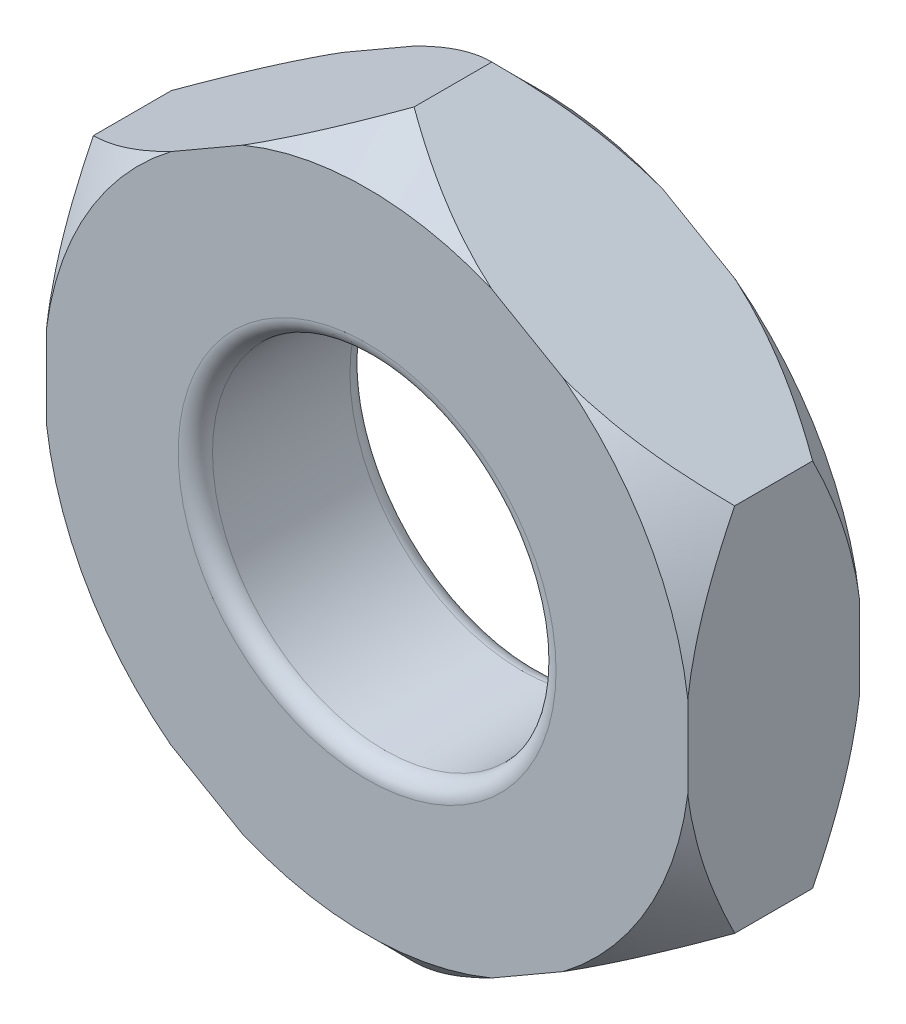
ISO-10303-21;
HEADER;
FILE_DESCRIPTION(('STEP AP214'),'2;1');
FILE_NAME('part.step','',(''),(''),'','','');
FILE_SCHEMA(('AUTOMOTIVE_DESIGN { 1 0 10303 214 1 1 1 1 }'));
ENDSEC;
DATA;
#1=APPLICATION_CONTEXT('core data for automotive mechanical design processes');
#2=APPLICATION_PROTOCOL_DEFINITION('international standard','automotive_design',2000,#1);
#3=PRODUCT_CONTEXT('',#1,'mechanical');
#4=PRODUCT('Part','Part','',(#3));
#5=PRODUCT_RELATED_PRODUCT_CATEGORY('part','',(#4));
#6=PRODUCT_DEFINITION_FORMATION('','',#4);
#7=PRODUCT_DEFINITION_CONTEXT('part definition',#1,'design');
#8=PRODUCT_DEFINITION('design','',#6,#7);
#9=PRODUCT_DEFINITION_SHAPE('','',#8);
#10=(LENGTH_UNIT() NAMED_UNIT(*) SI_UNIT(.MILLI.,.METRE.));
#11=(NAMED_UNIT(*) PLANE_ANGLE_UNIT() SI_UNIT($,.RADIAN.));
#12=(NAMED_UNIT(*) SI_UNIT($,.STERADIAN.) SOLID_ANGLE_UNIT());
#13=UNCERTAINTY_MEASURE_WITH_UNIT(LENGTH_MEASURE(1.E-05),#10,'distance_accuracy_value','');
#14=(GEOMETRIC_REPRESENTATION_CONTEXT(3) GLOBAL_UNCERTAINTY_ASSIGNED_CONTEXT((#13)) GLOBAL_UNIT_ASSIGNED_CONTEXT((#10,
#11,#12)) REPRESENTATION_CONTEXT('',''));
#15=CARTESIAN_POINT('',(0.,0.,0.));
#16=DIRECTION('',(0.,0.,1.));
#17=DIRECTION('',(1.,0.,0.));
#18=AXIS2_PLACEMENT_3D('',#15,#16,#17);
#19=CARTESIAN_POINT('',(2.8,1.61658075373095,-1.5));
#20=DIRECTION('',(0.5,0.866025403784439,0.));
#21=DIRECTION('',(-0.866025403784439,0.5,0.));
#22=AXIS2_PLACEMENT_3D('',#19,#20,#21);
#23=PLANE('',#22);
#24=DIRECTION('',(0.,0.,1.));
#25=VECTOR('',#24,1.);
#26=CARTESIAN_POINT('',(0.,3.2331615074619,-1.5));
#27=LINE('',#26,#25);
#28=CARTESIAN_POINT('',(0.,3.2331615074619,-1.09));
#29=VERTEX_POINT('',#28);
#30=CARTESIAN_POINT('',(0.,3.2331615074619,-0.41));
#31=VERTEX_POINT('',#30);
#32=EDGE_CURVE('E226',#29,#31,#27,.T.);
#33=ORIENTED_EDGE('',*,*,#32,.T.);
#34=CARTESIAN_POINT('',(-0.000700000000000846,3.23356565265034,-0.410404220956184));
#35=CARTESIAN_POINT('',(0.0955795792537454,3.17797861165072,-0.354849873121502));
#36=CARTESIAN_POINT('',(0.193469381876273,3.12146190775569,-0.302556963805771));
#37=CARTESIAN_POINT('',(0.393079210730305,3.00621711933392,-0.206807483108219));
#38=CARTESIAN_POINT('',(0.494818246616698,2.94747805957781,-0.163404228206856));
#39=CARTESIAN_POINT('',(0.699970477221649,2.82903336401319,-0.0890522572489255));
#40=CARTESIAN_POINT('',(0.803331354963252,2.7693579334254,-0.0579165382244305));
#41=CARTESIAN_POINT('',(1.0123300305261,2.64869249182891,-0.00994422958304566));
#42=CARTESIAN_POINT('',(1.11796143266115,2.58770617337137,0.00692820351901804));
#43=CARTESIAN_POINT('',(1.29998719470626,2.48261355065518,0.0221505785545191));
#44=CARTESIAN_POINT('',(1.3761460079225,2.43864323934362,0.0244055655288745));
#45=CARTESIAN_POINT('',(1.52833940842187,2.35077433859642,0.0206179327519953));
#46=CARTESIAN_POINT('',(1.60437394277193,2.30687577972171,0.0145724027412969));
#47=CARTESIAN_POINT('',(1.75572535689394,2.21949300003614,-0.00547225076720786));
#48=CARTESIAN_POINT('',(1.83104133666574,2.17600929884061,-0.0194802822999276));
#49=CARTESIAN_POINT('',(1.9803709995267,2.08979377778984,-0.0546809380405418));
#50=CARTESIAN_POINT('',(2.05438478190802,2.04706190060824,-0.0758730119480628));
#51=CARTESIAN_POINT('',(2.24405961895124,1.93755308238283,-0.138818795266773));
#52=CARTESIAN_POINT('',(2.35854209435516,1.87145659439089,-0.185328242984652));
#53=CARTESIAN_POINT('',(2.52687591199396,1.77426901946341,-0.263847340242155));
#54=CARTESIAN_POINT('',(2.5823490484883,1.74224158917561,-0.291436083477535));
#55=CARTESIAN_POINT('',(2.69226689627911,1.67878049016484,-0.349129274164181));
#56=CARTESIAN_POINT('',(2.74671221623508,1.64734647003215,-0.379232171564));
#57=CARTESIAN_POINT('',(2.8007,1.61617660854252,-0.410404220956184));
#58=B_SPLINE_CURVE_WITH_KNOTS('',3,(#34,#35,#36,#37,#38,#39,#40,#41,#42,#43,#44,#45,#46,#47,#48,
#49,#50,#51,#52,#53,#54,#55,#56,#57),.UNSPECIFIED.,.F.,.F.,(4,2,2,2,2,2,2,2,2,2,2,4),(0.,
0.373103823161989,0.748383760008528,1.11769848841447,1.48608235037116,1.74961742332421,
2.01324491839073,2.27716792838043,2.54107072633384,2.96059684404477,3.16979164088213,
3.37885840170202),.UNSPECIFIED.);
#59=CARTESIAN_POINT('',(1.08746092578539,2.60531564922651,0.));
#60=VERTEX_POINT('',#59);
#61=EDGE_CURVE('E194',#31,#60,#58,.T.);
#62=ORIENTED_EDGE('',*,*,#61,.T.);
#63=DIRECTION('',(-0.866025403784439,0.5,0.));
#64=VECTOR('',#63,1.);
#65=CARTESIAN_POINT('',(2.8,1.61658075373095,0.));
#66=LINE('',#65,#64);
#67=CARTESIAN_POINT('',(1.71253907421461,2.24442661196635,0.));
#68=VERTEX_POINT('',#67);
#69=EDGE_CURVE('E191',#68,#60,#66,.T.);
#70=ORIENTED_EDGE('',*,*,#69,.F.);
#71=CARTESIAN_POINT('',(2.8,1.61658075373095,-0.41));
#72=VERTEX_POINT('',#71);
#73=EDGE_CURVE('E173',#68,#72,#58,.T.);
#74=ORIENTED_EDGE('',*,*,#73,.T.);
#75=DIRECTION('',(0.,0.,1.));
#76=VECTOR('',#75,1.);
#77=CARTESIAN_POINT('',(2.8,1.61658075373095,-1.5));
#78=LINE('',#77,#76);
#79=CARTESIAN_POINT('',(2.8,1.61658075373095,-1.09));
#80=VERTEX_POINT('',#79);
#81=EDGE_CURVE('E188',#80,#72,#78,.T.);
#82=ORIENTED_EDGE('',*,*,#81,.F.);
#83=CARTESIAN_POINT('',(2.8007,1.61617660854252,-1.08959577904382));
#84=CARTESIAN_POINT('',(2.70442042074625,1.67176364954213,-1.1451501268785));
#85=CARTESIAN_POINT('',(2.60653061812372,1.72828035343717,-1.19744303619423));
#86=CARTESIAN_POINT('',(2.40692078926969,1.84352514185894,-1.29319251689178));
#87=CARTESIAN_POINT('',(2.3051817533833,1.90226420161504,-1.33659577179314));
#88=CARTESIAN_POINT('',(2.10002952277835,2.02070889717966,-1.41094774275107));
#89=CARTESIAN_POINT('',(1.99666864503675,2.08038432776745,-1.44208346177557));
#90=CARTESIAN_POINT('',(1.78766996947389,2.20104976936394,-1.49005577041695));
#91=CARTESIAN_POINT('',(1.68203856733885,2.26203608782149,-1.50692820351902));
#92=CARTESIAN_POINT('',(1.50001280529374,2.36712871053768,-1.52215057855452));
#93=CARTESIAN_POINT('',(1.4238539920775,2.41109902184923,-1.52440556552887));
#94=CARTESIAN_POINT('',(1.27166059157812,2.49896792259644,-1.520617932752));
#95=CARTESIAN_POINT('',(1.19562605722807,2.54286648147115,-1.5145724027413));
#96=CARTESIAN_POINT('',(1.04427464310606,2.63024926115672,-1.49452774923279));
#97=CARTESIAN_POINT('',(0.968958663334262,2.67373296235225,-1.48051971770007));
#98=CARTESIAN_POINT('',(0.8196290004733,2.75994848340302,-1.44531906195946));
#99=CARTESIAN_POINT('',(0.745615218091976,2.80268036058462,-1.42412698805194));
#100=CARTESIAN_POINT('',(0.555940381048752,2.91218917881002,-1.36118120473323));
#101=CARTESIAN_POINT('',(0.441457905644836,2.97828566680197,-1.31467175701535));
#102=CARTESIAN_POINT('',(0.273124088006036,3.07547324172945,-1.23615265975784));
#103=CARTESIAN_POINT('',(0.217650951511699,3.10750067201725,-1.20856391652246));
#104=CARTESIAN_POINT('',(0.107733103720892,3.17096177102801,-1.15087072583582));
#105=CARTESIAN_POINT('',(0.0532877837649167,3.20239579116071,-1.120767828436));
#106=CARTESIAN_POINT('',(-0.000700000000000954,3.23356565265034,-1.08959577904382));
#107=B_SPLINE_CURVE_WITH_KNOTS('',3,(#83,#84,#85,#86,#87,#88,#89,#90,#91,#92,#93,#94,#95,#96,
#97,#98,#99,#100,#101,#102,#103,#104,#105,#106),.UNSPECIFIED.,.F.,.F.,(4,2,2,2,2,2,2,2,2,2,2,4),
(0.,0.37310382316199,0.748383760008529,1.11769848841447,1.48608235037116,1.74961742332422,
2.01324491839073,2.27716792838043,2.54107072633385,2.96059684404477,3.16979164088213,
3.37885840170202),.UNSPECIFIED.);
#108=CARTESIAN_POINT('',(1.71253907421461,2.24442661196635,-1.5));
#109=VERTEX_POINT('',#108);
#110=EDGE_CURVE('E289',#80,#109,#107,.T.);
#111=ORIENTED_EDGE('',*,*,#110,.T.);
#112=DIRECTION('',(-0.866025403784439,0.5,0.));
#113=VECTOR('',#112,1.);
#114=CARTESIAN_POINT('',(2.8,1.61658075373095,-1.5));
#115=LINE('',#114,#113);
#116=CARTESIAN_POINT('',(1.08746092578539,2.60531564922651,-1.5));
#117=VERTEX_POINT('',#116);
#118=EDGE_CURVE('E308',#109,#117,#115,.T.);
#119=ORIENTED_EDGE('',*,*,#118,.T.);
#120=EDGE_CURVE('E363',#117,#29,#107,.T.);
#121=ORIENTED_EDGE('',*,*,#120,.T.);
#122=EDGE_LOOP('',(#33,#62,#70,#74,#82,#111,#119,#121));
#123=FACE_BOUND('',#122,.T.);
#124=ADVANCED_FACE('F45',(#123),#23,.T.);
#125=CARTESIAN_POINT('',(2.8,-1.61658075373095,-1.5));
#126=DIRECTION('',(1.,0.,0.));
#127=DIRECTION('',(0.,1.,0.));
#128=AXIS2_PLACEMENT_3D('',#125,#126,#127);
#129=PLANE('',#128);
#130=ORIENTED_EDGE('',*,*,#81,.T.);
#131=CARTESIAN_POINT('',(2.8,1.61728075373095,-0.410350056826765));
#132=CARTESIAN_POINT('',(2.8,1.5061132044498,-0.354801739725092));
#133=CARTESIAN_POINT('',(2.8,1.39308650464855,-0.302514761587192));
#134=CARTESIAN_POINT('',(2.8,1.16261098930572,-0.206776595658489));
#135=CARTESIAN_POINT('',(2.8,1.04514023039158,-0.163378710150931));
#136=CARTESIAN_POINT('',(2.8,0.808265751829126,-0.0890361916040844));
#137=CARTESIAN_POINT('',(2.8,0.688922423484141,-0.0579046025060009));
#138=CARTESIAN_POINT('',(2.8,0.44760709093306,-0.00993889771627575));
#139=CARTESIAN_POINT('',(2.8,0.325642468927563,0.00693105017102933));
#140=CARTESIAN_POINT('',(2.8,0.115465648657877,0.0221513605774256));
#141=CARTESIAN_POINT('',(2.8,0.0275253401569487,0.0244057395858546));
#142=CARTESIAN_POINT('',(2.8,-0.148211774585028,0.0206169601469645));
#143=CARTESIAN_POINT('',(2.8,-0.236008519689951,0.0145708917162211));
#144=CARTESIAN_POINT('',(2.8,-0.410773272932057,-0.00547473579486275));
#145=CARTESIAN_POINT('',(2.8,-0.497740242039395,-0.0194832007149876));
#146=CARTESIAN_POINT('',(2.8,-0.670170403090646,-0.054684609093444));
#147=CARTESIAN_POINT('',(2.8,-0.755633709707737,-0.0758770021668286));
#148=CARTESIAN_POINT('',(2.8,-0.974628859993182,-0.138817339838187));
#149=CARTESIAN_POINT('',(2.8,-1.10680050831653,-0.185318441699055));
#150=CARTESIAN_POINT('',(2.8,-1.30114489540137,-0.263822507348058));
#151=CARTESIAN_POINT('',(2.8,-1.365189703445,-0.291405822154836));
#152=CARTESIAN_POINT('',(2.8,-1.49209218141063,-0.349087507187175));
#153=CARTESIAN_POINT('',(2.8,-1.55495055343731,-0.379184328870487));
#154=CARTESIAN_POINT('',(2.8,-1.61728075373095,-0.410350056826767));
#155=B_SPLINE_CURVE_WITH_KNOTS('',3,(#131,#132,#133,#134,#135,#136,#137,#138,#139,#140,#141,
#142,#143,#144,#145,#146,#147,#148,#149,#150,#151,#152,#153,#154),.UNSPECIFIED.,.F.,.F.,(4,2,2,
2,2,2,2,2,2,2,2,4),(0.,0.37307814749604,0.748331832287194,1.11762166860141,1.48598088771918,
1.74951497173894,2.01314146953365,2.27706341209962,2.54096513928425,2.96042302480115,
3.16958369143192,3.37861643402933),.UNSPECIFIED.);
#156=CARTESIAN_POINT('',(2.8,0.360889037260158,0.));
#157=VERTEX_POINT('',#156);
#158=EDGE_CURVE('E170',#72,#157,#155,.T.);
#159=ORIENTED_EDGE('',*,*,#158,.T.);
#160=DIRECTION('',(0.,1.,0.));
#161=VECTOR('',#160,1.);
#162=CARTESIAN_POINT('',(2.8,-1.61658075373095,0.));
#163=LINE('',#162,#161);
#164=CARTESIAN_POINT('',(2.8,-0.360889037260154,0.));
#165=VERTEX_POINT('',#164);
#166=EDGE_CURVE('E212',#165,#157,#163,.T.);
#167=ORIENTED_EDGE('',*,*,#166,.F.);
#168=CARTESIAN_POINT('',(2.8,-1.61658075373095,-0.41));
#169=VERTEX_POINT('',#168);
#170=EDGE_CURVE('E181',#165,#169,#155,.T.);
#171=ORIENTED_EDGE('',*,*,#170,.T.);
#172=DIRECTION('',(0.,0.,1.));
#173=VECTOR('',#172,1.);
#174=CARTESIAN_POINT('',(2.8,-1.61658075373095,-1.5));
#175=LINE('',#174,#173);
#176=CARTESIAN_POINT('',(2.8,-1.61658075373095,-1.09));
#177=VERTEX_POINT('',#176);
#178=EDGE_CURVE('E201',#177,#169,#175,.T.);
#179=ORIENTED_EDGE('',*,*,#178,.F.);
#180=CARTESIAN_POINT('',(2.8,-1.61728075373095,-1.08964994317323));
#181=CARTESIAN_POINT('',(2.8,-1.50611320444979,-1.14519826027491));
#182=CARTESIAN_POINT('',(2.8,-1.39308650464855,-1.19748523841281));
#183=CARTESIAN_POINT('',(2.8,-1.16261098930572,-1.29322340434151));
#184=CARTESIAN_POINT('',(2.8,-1.04514023039158,-1.33662128984907));
#185=CARTESIAN_POINT('',(2.8,-0.808265751829124,-1.41096380839592));
#186=CARTESIAN_POINT('',(2.8,-0.688922423484138,-1.442095397494));
#187=CARTESIAN_POINT('',(2.8,-0.447607090933057,-1.49006110228372));
#188=CARTESIAN_POINT('',(2.8,-0.32564246892756,-1.50693105017103));
#189=CARTESIAN_POINT('',(2.8,-0.115465648657873,-1.52215136057743));
#190=CARTESIAN_POINT('',(2.8,-0.0275253401569455,-1.52440573958585));
#191=CARTESIAN_POINT('',(2.8,0.148211774585031,-1.52061696014696));
#192=CARTESIAN_POINT('',(2.8,0.236008519689954,-1.51457089171622));
#193=CARTESIAN_POINT('',(2.8,0.41077327293206,-1.49452526420514));
#194=CARTESIAN_POINT('',(2.8,0.497740242039397,-1.48051679928501));
#195=CARTESIAN_POINT('',(2.8,0.670170403090649,-1.44531539090656));
#196=CARTESIAN_POINT('',(2.8,0.75563370970774,-1.42412299783317));
#197=CARTESIAN_POINT('',(2.8,0.974628859993185,-1.36118266016181));
#198=CARTESIAN_POINT('',(2.8,1.10680050831653,-1.31468155830095));
#199=CARTESIAN_POINT('',(2.8,1.30114489540137,-1.23617749265194));
#200=CARTESIAN_POINT('',(2.8,1.365189703445,-1.20859417784517));
#201=CARTESIAN_POINT('',(2.8,1.49209218141063,-1.15091249281283));
#202=CARTESIAN_POINT('',(2.8,1.55495055343731,-1.12081567112951));
#203=CARTESIAN_POINT('',(2.8,1.61728075373095,-1.08964994317323));
#204=B_SPLINE_CURVE_WITH_KNOTS('',3,(#180,#181,#182,#183,#184,#185,#186,#187,#188,#189,#190,
#191,#192,#193,#194,#195,#196,#197,#198,#199,#200,#201,#202,#203),.UNSPECIFIED.,.F.,.F.,(4,2,2,
2,2,2,2,2,2,2,2,4),(0.,0.373078147496041,0.748331832287196,1.11762166860141,1.48598088771918,
1.74951497173894,2.01314146953365,2.27706341209962,2.54096513928425,2.96042302480115,
3.16958369143192,3.37861643402933),.UNSPECIFIED.);
#205=CARTESIAN_POINT('',(2.8,-0.360889037260154,-1.5));
#206=VERTEX_POINT('',#205);
#207=EDGE_CURVE('E312',#177,#206,#204,.T.);
#208=ORIENTED_EDGE('',*,*,#207,.T.);
#209=DIRECTION('',(0.,1.,0.));
#210=VECTOR('',#209,1.);
#211=CARTESIAN_POINT('',(2.8,-1.61658075373095,-1.5));
#212=LINE('',#211,#210);
#213=CARTESIAN_POINT('',(2.8,0.360889037260158,-1.5));
#214=VERTEX_POINT('',#213);
#215=EDGE_CURVE('E228',#206,#214,#212,.T.);
#216=ORIENTED_EDGE('',*,*,#215,.T.);
#217=EDGE_CURVE('E198',#214,#80,#204,.T.);
#218=ORIENTED_EDGE('',*,*,#217,.T.);
#219=EDGE_LOOP('',(#130,#159,#167,#171,#179,#208,#216,#218));
#220=FACE_BOUND('',#219,.T.);
#221=ADVANCED_FACE('F196',(#220),#129,.T.);
#222=CARTESIAN_POINT('',(0.,-3.2331615074619,-1.5));
#223=DIRECTION('',(0.5,-0.866025403784439,0.));
#224=DIRECTION('',(0.866025403784439,0.5,0.));
#225=AXIS2_PLACEMENT_3D('',#222,#223,#224);
#226=PLANE('',#225);
#227=ORIENTED_EDGE('',*,*,#178,.T.);
#228=CARTESIAN_POINT('',(2.8007,-1.61617660854252,-0.410404220956186));
#229=CARTESIAN_POINT('',(2.70442042074625,-1.67176364954213,-0.354849873121504));
#230=CARTESIAN_POINT('',(2.60653061812373,-1.72828035343717,-0.302556963805772));
#231=CARTESIAN_POINT('',(2.40692078926969,-1.84352514185894,-0.20680748310822));
#232=CARTESIAN_POINT('',(2.3051817533833,-1.90226420161504,-0.163404228206858));
#233=CARTESIAN_POINT('',(2.10002952277835,-2.02070889717966,-0.089052257248927));
#234=CARTESIAN_POINT('',(1.99666864503675,-2.08038432776745,-0.057916538224432));
#235=CARTESIAN_POINT('',(1.78766996947389,-2.20104976936394,-0.00994422958304728));
#236=CARTESIAN_POINT('',(1.68203856733885,-2.26203608782149,0.00692820351901621));
#237=CARTESIAN_POINT('',(1.50001280529374,-2.36712871053768,0.0221505785545175));
#238=CARTESIAN_POINT('',(1.4238539920775,-2.41109902184923,0.0244055655288732));
#239=CARTESIAN_POINT('',(1.27166059157813,-2.49896792259643,0.0206179327519941));
#240=CARTESIAN_POINT('',(1.19562605722807,-2.54286648147115,0.0145724027412954));
#241=CARTESIAN_POINT('',(1.04427464310606,-2.63024926115672,-0.00547225076720944));
#242=CARTESIAN_POINT('',(0.968958663334264,-2.67373296235225,-0.0194802822999291));
#243=CARTESIAN_POINT('',(0.819629000473301,-2.75994848340302,-0.0546809380405433));
#244=CARTESIAN_POINT('',(0.745615218091977,-2.80268036058462,-0.0758730119480644));
#245=CARTESIAN_POINT('',(0.555940381048754,-2.91218917881002,-0.138818795266775));
#246=CARTESIAN_POINT('',(0.441457905644838,-2.97828566680197,-0.185328242984653));
#247=CARTESIAN_POINT('',(0.273124088006038,-3.07547324172945,-0.263847340242156));
#248=CARTESIAN_POINT('',(0.217650951511702,-3.10750067201724,-0.291436083477536));
#249=CARTESIAN_POINT('',(0.107733103720894,-3.17096177102801,-0.349129274164182));
#250=CARTESIAN_POINT('',(0.0532877837649188,-3.20239579116071,-0.379232171564001));
#251=CARTESIAN_POINT('',(-0.000699999999999019,-3.23356565265034,-0.410404220956185));
#252=B_SPLINE_CURVE_WITH_KNOTS('',3,(#228,#229,#230,#231,#232,#233,#234,#235,#236,#237,#238,
#239,#240,#241,#242,#243,#244,#245,#246,#247,#248,#249,#250,#251),.UNSPECIFIED.,.F.,.F.,(4,2,2,
2,2,2,2,2,2,2,2,4),(0.,0.37310382316199,0.748383760008529,1.11769848841447,1.48608235037116,
1.74961742332422,2.01324491839073,2.27716792838043,2.54107072633385,2.96059684404477,
3.16979164088213,3.37885840170202),.UNSPECIFIED.);
#253=CARTESIAN_POINT('',(1.7125390742146,-2.24442661196636,0.));
#254=VERTEX_POINT('',#253);
#255=EDGE_CURVE('E406',#169,#254,#252,.T.);
#256=ORIENTED_EDGE('',*,*,#255,.T.);
#257=DIRECTION('',(0.866025403784439,0.5,0.));
#258=VECTOR('',#257,1.);
#259=CARTESIAN_POINT('',(0.,-3.2331615074619,0.));
#260=LINE('',#259,#258);
#261=CARTESIAN_POINT('',(1.0874609257854,-2.6053156492265,0.));
#262=VERTEX_POINT('',#261);
#263=EDGE_CURVE('E278',#262,#254,#260,.T.);
#264=ORIENTED_EDGE('',*,*,#263,.F.);
#265=CARTESIAN_POINT('',(0.,-3.2331615074619,-0.41));
#266=VERTEX_POINT('',#265);
#267=EDGE_CURVE('E399',#262,#266,#252,.T.);
#268=ORIENTED_EDGE('',*,*,#267,.T.);
#269=DIRECTION('',(0.,0.,1.));
#270=VECTOR('',#269,1.);
#271=CARTESIAN_POINT('',(0.,-3.2331615074619,-1.5));
#272=LINE('',#271,#270);
#273=CARTESIAN_POINT('',(0.,-3.2331615074619,-1.09));
#274=VERTEX_POINT('',#273);
#275=EDGE_CURVE('E209',#274,#266,#272,.T.);
#276=ORIENTED_EDGE('',*,*,#275,.F.);
#277=CARTESIAN_POINT('',(-0.000699999999999049,-3.23356565265034,-1.08959577904382));
#278=CARTESIAN_POINT('',(0.0955795792537471,-3.17797861165072,-1.1451501268785));
#279=CARTESIAN_POINT('',(0.193469381876275,-3.12146190775569,-1.19744303619423));
#280=CARTESIAN_POINT('',(0.393079210730307,-3.00621711933392,-1.29319251689178));
#281=CARTESIAN_POINT('',(0.494818246616699,-2.94747805957781,-1.33659577179314));
#282=CARTESIAN_POINT('',(0.699970477221651,-2.82903336401319,-1.41094774275107));
#283=CARTESIAN_POINT('',(0.803331354963253,-2.7693579334254,-1.44208346177557));
#284=CARTESIAN_POINT('',(1.01233003052611,-2.64869249182891,-1.49005577041695));
#285=CARTESIAN_POINT('',(1.11796143266115,-2.58770617337137,-1.50692820351902));
#286=CARTESIAN_POINT('',(1.29998719470626,-2.48261355065518,-1.52215057855452));
#287=CARTESIAN_POINT('',(1.3761460079225,-2.43864323934362,-1.52440556552887));
#288=CARTESIAN_POINT('',(1.52833940842187,-2.35077433859642,-1.52061793275199));
#289=CARTESIAN_POINT('',(1.60437394277193,-2.30687577972171,-1.5145724027413));
#290=CARTESIAN_POINT('',(1.75572535689394,-2.21949300003614,-1.49452774923279));
#291=CARTESIAN_POINT('',(1.83104133666574,-2.17600929884061,-1.48051971770007));
#292=CARTESIAN_POINT('',(1.9803709995267,-2.08979377778984,-1.44531906195946));
#293=CARTESIAN_POINT('',(2.05438478190802,-2.04706190060824,-1.42412698805194));
#294=CARTESIAN_POINT('',(2.24405961895125,-1.93755308238283,-1.36118120473323));
#295=CARTESIAN_POINT('',(2.35854209435516,-1.87145659439089,-1.31467175701535));
#296=CARTESIAN_POINT('',(2.52687591199396,-1.77426901946341,-1.23615265975784));
#297=CARTESIAN_POINT('',(2.5823490484883,-1.74224158917561,-1.20856391652246));
#298=CARTESIAN_POINT('',(2.69226689627911,-1.67878049016484,-1.15087072583582));
#299=CARTESIAN_POINT('',(2.74671221623508,-1.64734647003215,-1.120767828436));
#300=CARTESIAN_POINT('',(2.8007,-1.61617660854252,-1.08959577904381));
#301=B_SPLINE_CURVE_WITH_KNOTS('',3,(#277,#278,#279,#280,#281,#282,#283,#284,#285,#286,#287,
#288,#289,#290,#291,#292,#293,#294,#295,#296,#297,#298,#299,#300),.UNSPECIFIED.,.F.,.F.,(4,2,2,
2,2,2,2,2,2,2,2,4),(0.,0.373103823161988,0.748383760008527,1.11769848841447,1.48608235037116,
1.74961742332421,2.01324491839072,2.27716792838043,2.54107072633384,2.96059684404477,
3.16979164088213,3.37885840170202),.UNSPECIFIED.);
#302=CARTESIAN_POINT('',(1.0874609257854,-2.6053156492265,-1.5));
#303=VERTEX_POINT('',#302);
#304=EDGE_CURVE('E323',#274,#303,#301,.T.);
#305=ORIENTED_EDGE('',*,*,#304,.T.);
#306=DIRECTION('',(0.866025403784439,0.5,0.));
#307=VECTOR('',#306,1.);
#308=CARTESIAN_POINT('',(0.,-3.2331615074619,-1.5));
#309=LINE('',#308,#307);
#310=CARTESIAN_POINT('',(1.7125390742146,-2.24442661196636,-1.5));
#311=VERTEX_POINT('',#310);
#312=EDGE_CURVE('E292',#303,#311,#309,.T.);
#313=ORIENTED_EDGE('',*,*,#312,.T.);
#314=EDGE_CURVE('E322',#311,#177,#301,.T.);
#315=ORIENTED_EDGE('',*,*,#314,.T.);
#316=EDGE_LOOP('',(#227,#256,#264,#268,#276,#305,#313,#315));
#317=FACE_BOUND('',#316,.T.);
#318=ADVANCED_FACE('F381',(#317),#226,.T.);
#319=CARTESIAN_POINT('',(-2.8,-1.61658075373095,-1.5));
#320=DIRECTION('',(-0.5,-0.866025403784439,0.));
#321=DIRECTION('',(0.866025403784439,-0.5,0.));
#322=AXIS2_PLACEMENT_3D('',#319,#320,#321);
#323=PLANE('',#322);
#324=ORIENTED_EDGE('',*,*,#275,.T.);
#325=CARTESIAN_POINT('',(0.000700000000000957,-3.23356565265034,-0.410404220956184));
#326=CARTESIAN_POINT('',(-0.0955795792537456,-3.17797861165072,-0.354849873121503));
#327=CARTESIAN_POINT('',(-0.193469381876274,-3.12146190775569,-0.302556963805771));
#328=CARTESIAN_POINT('',(-0.393079210730305,-3.00621711933392,-0.20680748310822));
#329=CARTESIAN_POINT('',(-0.494818246616698,-2.94747805957781,-0.163404228206857));
#330=CARTESIAN_POINT('',(-0.699970477221649,-2.82903336401319,-0.0890522572489262));
#331=CARTESIAN_POINT('',(-0.803331354963252,-2.7693579334254,-0.0579165382244311));
#332=CARTESIAN_POINT('',(-1.0123300305261,-2.64869249182891,-0.00994422958304648));
#333=CARTESIAN_POINT('',(-1.11796143266115,-2.58770617337137,0.00692820351901677));
#334=CARTESIAN_POINT('',(-1.29998719470626,-2.48261355065518,0.022150578554518));
#335=CARTESIAN_POINT('',(-1.37614600792249,-2.43864323934362,0.0244055655288738));
#336=CARTESIAN_POINT('',(-1.52833940842187,-2.35077433859642,0.0206179327519946));
#337=CARTESIAN_POINT('',(-1.60437394277192,-2.30687577972171,0.0145724027412956));
#338=CARTESIAN_POINT('',(-1.75572535689393,-2.21949300003614,-0.00547225076720902));
#339=CARTESIAN_POINT('',(-1.83104133666573,-2.17600929884061,-0.0194802822999282));
#340=CARTESIAN_POINT('',(-1.9803709995267,-2.08979377778984,-0.0546809380405418));
#341=CARTESIAN_POINT('',(-2.05438478190802,-2.04706190060824,-0.0758730119480627));
#342=CARTESIAN_POINT('',(-2.24405961895124,-1.93755308238283,-0.138818795266773));
#343=CARTESIAN_POINT('',(-2.35854209435516,-1.87145659439089,-0.185328242984653));
#344=CARTESIAN_POINT('',(-2.52687591199396,-1.77426901946341,-0.263847340242156));
#345=CARTESIAN_POINT('',(-2.5823490484883,-1.74224158917561,-0.291436083477536));
#346=CARTESIAN_POINT('',(-2.69226689627911,-1.67878049016484,-0.349129274164182));
#347=CARTESIAN_POINT('',(-2.74671221623508,-1.64734647003215,-0.379232171564001));
#348=CARTESIAN_POINT('',(-2.8007,-1.61617660854252,-0.410404220956186));
#349=B_SPLINE_CURVE_WITH_KNOTS('',3,(#325,#326,#327,#328,#329,#330,#331,#332,#333,#334,#335,
#336,#337,#338,#339,#340,#341,#342,#343,#344,#345,#346,#347,#348),.UNSPECIFIED.,.F.,.F.,(4,2,2,
2,2,2,2,2,2,2,2,4),(0.,0.373103823161989,0.748383760008527,1.11769848841447,1.48608235037116,
1.74961742332421,2.01324491839072,2.27716792838043,2.54107072633384,2.96059684404477,
3.16979164088213,3.37885840170202),.UNSPECIFIED.);
#350=CARTESIAN_POINT('',(-1.08746092578539,-2.60531564922651,0.));
#351=VERTEX_POINT('',#350);
#352=EDGE_CURVE('E276',#266,#351,#349,.T.);
#353=ORIENTED_EDGE('',*,*,#352,.T.);
#354=DIRECTION('',(0.866025403784439,-0.5,0.));
#355=VECTOR('',#354,1.);
#356=CARTESIAN_POINT('',(-2.8,-1.61658075373095,0.));
#357=LINE('',#356,#355);
#358=CARTESIAN_POINT('',(-1.7125390742146,-2.24442661196635,0.));
#359=VERTEX_POINT('',#358);
#360=EDGE_CURVE('E266',#359,#351,#357,.T.);
#361=ORIENTED_EDGE('',*,*,#360,.F.);
#362=CARTESIAN_POINT('',(-2.8,-1.61658075373095,-0.41));
#363=VERTEX_POINT('',#362);
#364=EDGE_CURVE('E275',#359,#363,#349,.T.);
#365=ORIENTED_EDGE('',*,*,#364,.T.);
#366=DIRECTION('',(0.,0.,1.));
#367=VECTOR('',#366,1.);
#368=CARTESIAN_POINT('',(-2.8,-1.61658075373095,-1.5));
#369=LINE('',#368,#367);
#370=CARTESIAN_POINT('',(-2.8,-1.61658075373095,-1.09));
#371=VERTEX_POINT('',#370);
#372=EDGE_CURVE('E218',#371,#363,#369,.T.);
#373=ORIENTED_EDGE('',*,*,#372,.F.);
#374=CARTESIAN_POINT('',(-2.8007,-1.61617660854252,-1.08959577904381));
#375=CARTESIAN_POINT('',(-2.70442042074625,-1.67176364954213,-1.1451501268785));
#376=CARTESIAN_POINT('',(-2.60653061812373,-1.72828035343717,-1.19744303619423));
#377=CARTESIAN_POINT('',(-2.40692078926969,-1.84352514185894,-1.29319251689178));
#378=CARTESIAN_POINT('',(-2.3051817533833,-1.90226420161504,-1.33659577179314));
#379=CARTESIAN_POINT('',(-2.10002952277835,-2.02070889717966,-1.41094774275107));
#380=CARTESIAN_POINT('',(-1.99666864503675,-2.08038432776745,-1.44208346177557));
#381=CARTESIAN_POINT('',(-1.78766996947389,-2.20104976936394,-1.49005577041695));
#382=CARTESIAN_POINT('',(-1.68203856733885,-2.26203608782149,-1.50692820351902));
#383=CARTESIAN_POINT('',(-1.50001280529374,-2.36712871053768,-1.52215057855452));
#384=CARTESIAN_POINT('',(-1.4238539920775,-2.41109902184923,-1.52440556552887));
#385=CARTESIAN_POINT('',(-1.27166059157813,-2.49896792259643,-1.52061793275199));
#386=CARTESIAN_POINT('',(-1.19562605722807,-2.54286648147114,-1.5145724027413));
#387=CARTESIAN_POINT('',(-1.04427464310606,-2.63024926115672,-1.49452774923279));
#388=CARTESIAN_POINT('',(-0.968958663334264,-2.67373296235225,-1.48051971770007));
#389=CARTESIAN_POINT('',(-0.819629000473302,-2.75994848340302,-1.44531906195946));
#390=CARTESIAN_POINT('',(-0.745615218091978,-2.80268036058462,-1.42412698805194));
#391=CARTESIAN_POINT('',(-0.555940381048754,-2.91218917881002,-1.36118120473323));
#392=CARTESIAN_POINT('',(-0.441457905644837,-2.97828566680197,-1.31467175701535));
#393=CARTESIAN_POINT('',(-0.273124088006037,-3.07547324172945,-1.23615265975785));
#394=CARTESIAN_POINT('',(-0.2176509515117,-3.10750067201724,-1.20856391652246));
#395=CARTESIAN_POINT('',(-0.107733103720893,-3.17096177102801,-1.15087072583582));
#396=CARTESIAN_POINT('',(-0.0532877837649172,-3.20239579116071,-1.120767828436));
#397=CARTESIAN_POINT('',(0.000700000000000773,-3.23356565265034,-1.08959577904382));
#398=B_SPLINE_CURVE_WITH_KNOTS('',3,(#374,#375,#376,#377,#378,#379,#380,#381,#382,#383,#384,
#385,#386,#387,#388,#389,#390,#391,#392,#393,#394,#395,#396,#397),.UNSPECIFIED.,.F.,.F.,(4,2,2,
2,2,2,2,2,2,2,2,4),(0.,0.373103823161989,0.748383760008528,1.11769848841447,1.48608235037116,
1.74961742332421,2.01324491839073,2.27716792838043,2.54107072633385,2.96059684404478,
3.16979164088214,3.37885840170202),.UNSPECIFIED.);
#399=CARTESIAN_POINT('',(-1.7125390742146,-2.24442661196635,-1.5));
#400=VERTEX_POINT('',#399);
#401=EDGE_CURVE('E369',#371,#400,#398,.T.);
#402=ORIENTED_EDGE('',*,*,#401,.T.);
#403=DIRECTION('',(0.866025403784439,-0.5,0.));
#404=VECTOR('',#403,1.);
#405=CARTESIAN_POINT('',(-2.8,-1.61658075373095,-1.5));
#406=LINE('',#405,#404);
#407=CARTESIAN_POINT('',(-1.08746092578539,-2.60531564922651,-1.5));
#408=VERTEX_POINT('',#407);
#409=EDGE_CURVE('E296',#400,#408,#406,.T.);
#410=ORIENTED_EDGE('',*,*,#409,.T.);
#411=EDGE_CURVE('E377',#408,#274,#398,.T.);
#412=ORIENTED_EDGE('',*,*,#411,.T.);
#413=EDGE_LOOP('',(#324,#353,#361,#365,#373,#402,#410,#412));
#414=FACE_BOUND('',#413,.T.);
#415=ADVANCED_FACE('F273',(#414),#323,.T.);
#416=CARTESIAN_POINT('',(-2.8,1.61658075373095,-1.5));
#417=DIRECTION('',(-1.,0.,0.));
#418=DIRECTION('',(0.,-1.,0.));
#419=AXIS2_PLACEMENT_3D('',#416,#417,#418);
#420=PLANE('',#419);
#421=ORIENTED_EDGE('',*,*,#372,.T.);
#422=CARTESIAN_POINT('',(-2.8,-1.61728075373095,-0.410350056826766));
#423=CARTESIAN_POINT('',(-2.8,-1.50611320444979,-0.354801739725093));
#424=CARTESIAN_POINT('',(-2.8,-1.39308650464855,-0.302514761587194));
#425=CARTESIAN_POINT('',(-2.8,-1.16261098930572,-0.206776595658491));
#426=CARTESIAN_POINT('',(-2.8,-1.04514023039158,-0.163378710150933));
#427=CARTESIAN_POINT('',(-2.8,-0.808265751829126,-0.0890361916040859));
#428=CARTESIAN_POINT('',(-2.8,-0.688922423484141,-0.0579046025060023));
#429=CARTESIAN_POINT('',(-2.8,-0.447607090933059,-0.00993889771627716));
#430=CARTESIAN_POINT('',(-2.8,-0.325642468927563,0.00693105017102795));
#431=CARTESIAN_POINT('',(-2.8,-0.115465648657876,0.0221513605774243));
#432=CARTESIAN_POINT('',(-2.8,-0.0275253401569482,0.0244057395858532));
#433=CARTESIAN_POINT('',(-2.8,0.148211774585028,0.0206169601469633));
#434=CARTESIAN_POINT('',(-2.8,0.236008519689952,0.0145708917162199));
#435=CARTESIAN_POINT('',(-2.8,0.410773272932058,-0.00547473579486397));
#436=CARTESIAN_POINT('',(-2.8,0.497740242039395,-0.0194832007149888));
#437=CARTESIAN_POINT('',(-2.8,0.670170403090647,-0.054684609093445));
#438=CARTESIAN_POINT('',(-2.8,0.755633709707738,-0.0758770021668294));
#439=CARTESIAN_POINT('',(-2.8,0.974628859993182,-0.138817339838188));
#440=CARTESIAN_POINT('',(-2.8,1.10680050831653,-0.185318441699055));
#441=CARTESIAN_POINT('',(-2.8,1.30114489540137,-0.263822507348058));
#442=CARTESIAN_POINT('',(-2.8,1.365189703445,-0.291405822154836));
#443=CARTESIAN_POINT('',(-2.8,1.49209218141063,-0.349087507187175));
#444=CARTESIAN_POINT('',(-2.8,1.55495055343731,-0.379184328870487));
#445=CARTESIAN_POINT('',(-2.8,1.61728075373095,-0.410350056826767));
#446=B_SPLINE_CURVE_WITH_KNOTS('',3,(#422,#423,#424,#425,#426,#427,#428,#429,#430,#431,#432,
#433,#434,#435,#436,#437,#438,#439,#440,#441,#442,#443,#444,#445),.UNSPECIFIED.,.F.,.F.,(4,2,2,
2,2,2,2,2,2,2,2,4),(0.,0.37307814749604,0.748331832287193,1.11762166860141,1.48598088771917,
1.74951497173894,2.01314146953365,2.27706341209962,2.54096513928425,2.96042302480115,
3.16958369143192,3.37861643402932),.UNSPECIFIED.);
#447=CARTESIAN_POINT('',(-2.8,-0.360889037260147,0.));
#448=VERTEX_POINT('',#447);
#449=EDGE_CURVE('E393',#363,#448,#446,.T.);
#450=ORIENTED_EDGE('',*,*,#449,.T.);
#451=DIRECTION('',(0.,-1.,0.));
#452=VECTOR('',#451,1.);
#453=CARTESIAN_POINT('',(-2.8,1.61658075373095,0.));
#454=LINE('',#453,#452);
#455=CARTESIAN_POINT('',(-2.8,0.360889037260147,0.));
#456=VERTEX_POINT('',#455);
#457=EDGE_CURVE('E267',#456,#448,#454,.T.);
#458=ORIENTED_EDGE('',*,*,#457,.F.);
#459=CARTESIAN_POINT('',(-2.8,1.61658075373095,-0.41));
#460=VERTEX_POINT('',#459);
#461=EDGE_CURVE('E394',#456,#460,#446,.T.);
#462=ORIENTED_EDGE('',*,*,#461,.T.);
#463=DIRECTION('',(0.,0.,1.));
#464=VECTOR('',#463,1.);
#465=CARTESIAN_POINT('',(-2.8,1.61658075373095,-1.5));
#466=LINE('',#465,#464);
#467=CARTESIAN_POINT('',(-2.8,1.61658075373095,-1.09));
#468=VERTEX_POINT('',#467);
#469=EDGE_CURVE('E222',#468,#460,#466,.T.);
#470=ORIENTED_EDGE('',*,*,#469,.F.);
#471=CARTESIAN_POINT('',(-2.8,1.61728075373095,-1.08964994317323));
#472=CARTESIAN_POINT('',(-2.8,1.50611320444979,-1.14519826027491));
#473=CARTESIAN_POINT('',(-2.8,1.39308650464855,-1.19748523841281));
#474=CARTESIAN_POINT('',(-2.8,1.16261098930572,-1.29322340434151));
#475=CARTESIAN_POINT('',(-2.8,1.04514023039158,-1.33662128984907));
#476=CARTESIAN_POINT('',(-2.8,0.808265751829125,-1.41096380839591));
#477=CARTESIAN_POINT('',(-2.8,0.68892242348414,-1.442095397494));
#478=CARTESIAN_POINT('',(-2.8,0.447607090933058,-1.49006110228372));
#479=CARTESIAN_POINT('',(-2.8,0.325642468927561,-1.50693105017103));
#480=CARTESIAN_POINT('',(-2.8,0.115465648657874,-1.52215136057742));
#481=CARTESIAN_POINT('',(-2.8,0.0275253401569465,-1.52440573958585));
#482=CARTESIAN_POINT('',(-2.8,-0.14821177458503,-1.52061696014696));
#483=CARTESIAN_POINT('',(-2.8,-0.236008519689954,-1.51457089171622));
#484=CARTESIAN_POINT('',(-2.8,-0.41077327293206,-1.49452526420514));
#485=CARTESIAN_POINT('',(-2.8,-0.497740242039397,-1.48051679928501));
#486=CARTESIAN_POINT('',(-2.8,-0.670170403090648,-1.44531539090656));
#487=CARTESIAN_POINT('',(-2.8,-0.755633709707739,-1.42412299783317));
#488=CARTESIAN_POINT('',(-2.8,-0.974628859993183,-1.36118266016181));
#489=CARTESIAN_POINT('',(-2.8,-1.10680050831653,-1.31468155830095));
#490=CARTESIAN_POINT('',(-2.8,-1.30114489540137,-1.23617749265194));
#491=CARTESIAN_POINT('',(-2.8,-1.365189703445,-1.20859417784516));
#492=CARTESIAN_POINT('',(-2.8,-1.49209218141063,-1.15091249281283));
#493=CARTESIAN_POINT('',(-2.8,-1.55495055343731,-1.12081567112951));
#494=CARTESIAN_POINT('',(-2.8,-1.61728075373095,-1.08964994317323));
#495=B_SPLINE_CURVE_WITH_KNOTS('',3,(#471,#472,#473,#474,#475,#476,#477,#478,#479,#480,#481,
#482,#483,#484,#485,#486,#487,#488,#489,#490,#491,#492,#493,#494),.UNSPECIFIED.,.F.,.F.,(4,2,2,
2,2,2,2,2,2,2,2,4),(0.,0.373078147496039,0.748331832287194,1.11762166860141,1.48598088771918,
1.74951497173894,2.01314146953365,2.27706341209962,2.54096513928425,2.96042302480115,
3.16958369143192,3.37861643402932),.UNSPECIFIED.);
#496=CARTESIAN_POINT('',(-2.8,0.360889037260147,-1.5));
#497=VERTEX_POINT('',#496);
#498=EDGE_CURVE('E355',#468,#497,#495,.T.);
#499=ORIENTED_EDGE('',*,*,#498,.T.);
#500=DIRECTION('',(0.,-1.,0.));
#501=VECTOR('',#500,1.);
#502=CARTESIAN_POINT('',(-2.8,1.61658075373095,-1.5));
#503=LINE('',#502,#501);
#504=CARTESIAN_POINT('',(-2.8,-0.360889037260147,-1.5));
#505=VERTEX_POINT('',#504);
#506=EDGE_CURVE('E300',#497,#505,#503,.T.);
#507=ORIENTED_EDGE('',*,*,#506,.T.);
#508=EDGE_CURVE('E70',#505,#371,#495,.T.);
#509=ORIENTED_EDGE('',*,*,#508,.T.);
#510=EDGE_LOOP('',(#421,#450,#458,#462,#470,#499,#507,#509));
#511=FACE_BOUND('',#510,.T.);
#512=ADVANCED_FACE('F380',(#511),#420,.T.);
#513=CARTESIAN_POINT('',(0.,3.2331615074619,-1.5));
#514=DIRECTION('',(-0.5,0.866025403784439,0.));
#515=DIRECTION('',(-0.866025403784439,-0.5,0.));
#516=AXIS2_PLACEMENT_3D('',#513,#514,#515);
#517=PLANE('',#516);
#518=ORIENTED_EDGE('',*,*,#469,.T.);
#519=CARTESIAN_POINT('',(-2.8007,1.61617660854252,-0.410404220956186));
#520=CARTESIAN_POINT('',(-2.70442042074625,1.67176364954213,-0.354849873121503));
#521=CARTESIAN_POINT('',(-2.60653061812373,1.72828035343717,-0.302556963805772));
#522=CARTESIAN_POINT('',(-2.40692078926969,1.84352514185894,-0.20680748310822));
#523=CARTESIAN_POINT('',(-2.3051817533833,1.90226420161504,-0.163404228206857));
#524=CARTESIAN_POINT('',(-2.10002952277835,2.02070889717966,-0.089052257248926));
#525=CARTESIAN_POINT('',(-1.99666864503675,2.08038432776745,-0.0579165382244308));
#526=CARTESIAN_POINT('',(-1.78766996947389,2.20104976936394,-0.00994422958304585));
#527=CARTESIAN_POINT('',(-1.68203856733885,2.26203608782149,0.0069282035190176));
#528=CARTESIAN_POINT('',(-1.50001280529374,2.36712871053768,0.0221505785545189));
#529=CARTESIAN_POINT('',(-1.4238539920775,2.41109902184923,0.0244055655288746));
#530=CARTESIAN_POINT('',(-1.27166059157812,2.49896792259644,0.0206179327519953));
#531=CARTESIAN_POINT('',(-1.19562605722807,2.54286648147115,0.0145724027412965));
#532=CARTESIAN_POINT('',(-1.04427464310606,2.63024926115672,-0.00547225076720839));
#533=CARTESIAN_POINT('',(-0.968958663334263,2.67373296235225,-0.019480282299928));
#534=CARTESIAN_POINT('',(-0.819629000473301,2.75994848340302,-0.0546809380405421));
#535=CARTESIAN_POINT('',(-0.745615218091977,2.80268036058462,-0.0758730119480632));
#536=CARTESIAN_POINT('',(-0.555940381048753,2.91218917881002,-0.138818795266774));
#537=CARTESIAN_POINT('',(-0.441457905644837,2.97828566680197,-0.185328242984653));
#538=CARTESIAN_POINT('',(-0.273124088006037,3.07547324172945,-0.263847340242155));
#539=CARTESIAN_POINT('',(-0.217650951511701,3.10750067201725,-0.291436083477535));
#540=CARTESIAN_POINT('',(-0.107733103720894,3.17096177102801,-0.34912927416418));
#541=CARTESIAN_POINT('',(-0.0532877837649182,3.20239579116071,-0.379232171563999));
#542=CARTESIAN_POINT('',(0.000699999999999198,3.23356565265034,-0.410404220956184));
#543=B_SPLINE_CURVE_WITH_KNOTS('',3,(#519,#520,#521,#522,#523,#524,#525,#526,#527,#528,#529,
#530,#531,#532,#533,#534,#535,#536,#537,#538,#539,#540,#541,#542),.UNSPECIFIED.,.F.,.F.,(4,2,2,
2,2,2,2,2,2,2,2,4),(0.,0.373103823161991,0.74838376000853,1.11769848841447,1.48608235037117,
1.74961742332422,2.01324491839073,2.27716792838044,2.54107072633385,2.96059684404478,
3.16979164088214,3.37885840170202),.UNSPECIFIED.);
#544=CARTESIAN_POINT('',(-1.7125390742146,2.24442661196635,0.));
#545=VERTEX_POINT('',#544);
#546=EDGE_CURVE('E454',#460,#545,#543,.T.);
#547=ORIENTED_EDGE('',*,*,#546,.T.);
#548=DIRECTION('',(-0.866025403784439,-0.5,0.));
#549=VECTOR('',#548,1.);
#550=CARTESIAN_POINT('',(0.,3.2331615074619,0.));
#551=LINE('',#550,#549);
#552=CARTESIAN_POINT('',(-1.0874609257854,2.60531564922651,0.));
#553=VERTEX_POINT('',#552);
#554=EDGE_CURVE('E282',#553,#545,#551,.T.);
#555=ORIENTED_EDGE('',*,*,#554,.F.);
#556=EDGE_CURVE('E445',#553,#31,#543,.T.);
#557=ORIENTED_EDGE('',*,*,#556,.T.);
#558=ORIENTED_EDGE('',*,*,#32,.F.);
#559=CARTESIAN_POINT('',(0.00069999999999916,3.23356565265034,-1.08959577904382));
#560=CARTESIAN_POINT('',(-0.0955795792537473,3.17797861165072,-1.1451501268785));
#561=CARTESIAN_POINT('',(-0.193469381876276,3.12146190775569,-1.19744303619423));
#562=CARTESIAN_POINT('',(-0.393079210730307,3.00621711933392,-1.29319251689178));
#563=CARTESIAN_POINT('',(-0.4948182466167,2.94747805957781,-1.33659577179314));
#564=CARTESIAN_POINT('',(-0.699970477221652,2.82903336401319,-1.41094774275107));
#565=CARTESIAN_POINT('',(-0.803331354963254,2.7693579334254,-1.44208346177557));
#566=CARTESIAN_POINT('',(-1.01233003052611,2.64869249182891,-1.49005577041695));
#567=CARTESIAN_POINT('',(-1.11796143266115,2.58770617337137,-1.50692820351902));
#568=CARTESIAN_POINT('',(-1.29998719470626,2.48261355065518,-1.52215057855452));
#569=CARTESIAN_POINT('',(-1.3761460079225,2.43864323934362,-1.52440556552887));
#570=CARTESIAN_POINT('',(-1.52833940842187,2.35077433859642,-1.52061793275199));
#571=CARTESIAN_POINT('',(-1.60437394277193,2.30687577972171,-1.5145724027413));
#572=CARTESIAN_POINT('',(-1.75572535689394,2.21949300003614,-1.49452774923279));
#573=CARTESIAN_POINT('',(-1.83104133666574,2.17600929884061,-1.48051971770007));
#574=CARTESIAN_POINT('',(-1.9803709995267,2.08979377778984,-1.44531906195946));
#575=CARTESIAN_POINT('',(-2.05438478190802,2.04706190060824,-1.42412698805194));
#576=CARTESIAN_POINT('',(-2.24405961895125,1.93755308238283,-1.36118120473323));
#577=CARTESIAN_POINT('',(-2.35854209435516,1.87145659439089,-1.31467175701535));
#578=CARTESIAN_POINT('',(-2.52687591199396,1.77426901946341,-1.23615265975784));
#579=CARTESIAN_POINT('',(-2.5823490484883,1.74224158917561,-1.20856391652246));
#580=CARTESIAN_POINT('',(-2.69226689627911,1.67878049016484,-1.15087072583582));
#581=CARTESIAN_POINT('',(-2.74671221623508,1.64734647003215,-1.120767828436));
#582=CARTESIAN_POINT('',(-2.8007,1.61617660854252,-1.08959577904381));
#583=B_SPLINE_CURVE_WITH_KNOTS('',3,(#559,#560,#561,#562,#563,#564,#565,#566,#567,#568,#569,
#570,#571,#572,#573,#574,#575,#576,#577,#578,#579,#580,#581,#582),.UNSPECIFIED.,.F.,.F.,(4,2,2,
2,2,2,2,2,2,2,2,4),(0.,0.373103823161989,0.748383760008528,1.11769848841447,1.48608235037116,
1.74961742332421,2.01324491839072,2.27716792838043,2.54107072633384,2.96059684404477,
3.16979164088213,3.37885840170202),.UNSPECIFIED.);
#584=CARTESIAN_POINT('',(-1.0874609257854,2.60531564922651,-1.5));
#585=VERTEX_POINT('',#584);
#586=EDGE_CURVE('E656',#29,#585,#583,.T.);
#587=ORIENTED_EDGE('',*,*,#586,.T.);
#588=DIRECTION('',(-0.866025403784439,-0.5,0.));
#589=VECTOR('',#588,1.);
#590=CARTESIAN_POINT('',(0.,3.2331615074619,-1.5));
#591=LINE('',#590,#589);
#592=CARTESIAN_POINT('',(-1.7125390742146,2.24442661196635,-1.5));
#593=VERTEX_POINT('',#592);
#594=EDGE_CURVE('E304',#585,#593,#591,.T.);
#595=ORIENTED_EDGE('',*,*,#594,.T.);
#596=EDGE_CURVE('E62',#593,#468,#583,.T.);
#597=ORIENTED_EDGE('',*,*,#596,.T.);
#598=EDGE_LOOP('',(#518,#547,#555,#557,#558,#587,#595,#597));
#599=FACE_BOUND('',#598,.T.);
#600=ADVANCED_FACE('F459',(#599),#517,.T.);
#601=CARTESIAN_POINT('',(0.,0.,-1.5));
#602=DIRECTION('',(0.,0.,1.));
#603=DIRECTION('',(1.,0.,0.));
#604=AXIS2_PLACEMENT_3D('',#601,#602,#603);
#605=PLANE('',#604);
#606=CARTESIAN_POINT('',(0.,0.,-1.5));
#607=DIRECTION('',(0.,0.,1.));
#608=DIRECTION('',(1.,0.,0.));
#609=AXIS2_PLACEMENT_3D('',#606,#607,#608);
#610=CIRCLE('',#609,1.65);
#611=CARTESIAN_POINT('',(1.65,0.,-1.5));
#612=VERTEX_POINT('',#611);
#613=EDGE_CURVE('E237',#612,#612,#610,.T.);
#614=ORIENTED_EDGE('',*,*,#613,.T.);
#615=EDGE_LOOP('',(#614));
#616=FACE_BOUND('',#615,.T.);
#617=CARTESIAN_POINT('',(0.,0.,-1.5));
#618=DIRECTION('',(0.,0.,1.));
#619=DIRECTION('',(1.,0.,0.));
#620=AXIS2_PLACEMENT_3D('',#617,#618,#619);
#621=CIRCLE('',#620,2.8231615074619);
#622=EDGE_CURVE('E439',#214,#109,#621,.T.);
#623=ORIENTED_EDGE('',*,*,#622,.F.);
#624=ORIENTED_EDGE('',*,*,#215,.F.);
#625=CARTESIAN_POINT('',(0.,0.,-1.5));
#626=DIRECTION('',(0.,0.,1.));
#627=DIRECTION('',(1.,0.,0.));
#628=AXIS2_PLACEMENT_3D('',#625,#626,#627);
#629=CIRCLE('',#628,2.8231615074619);
#630=EDGE_CURVE('E49',#311,#206,#629,.T.);
#631=ORIENTED_EDGE('',*,*,#630,.F.);
#632=ORIENTED_EDGE('',*,*,#312,.F.);
#633=EDGE_CURVE('E257',#408,#303,#629,.T.);
#634=ORIENTED_EDGE('',*,*,#633,.F.);
#635=ORIENTED_EDGE('',*,*,#409,.F.);
#636=EDGE_CURVE('E647',#505,#400,#629,.T.);
#637=ORIENTED_EDGE('',*,*,#636,.F.);
#638=ORIENTED_EDGE('',*,*,#506,.F.);
#639=EDGE_CURVE('E55',#593,#497,#629,.T.);
#640=ORIENTED_EDGE('',*,*,#639,.F.);
#641=ORIENTED_EDGE('',*,*,#594,.F.);
#642=EDGE_CURVE('E11',#117,#585,#629,.T.);
#643=ORIENTED_EDGE('',*,*,#642,.F.);
#644=ORIENTED_EDGE('',*,*,#118,.F.);
#645=EDGE_LOOP('',(#623,#624,#631,#632,#634,#635,#637,#638,#640,#641,#643,#644));
#646=FACE_BOUND('',#645,.T.);
#647=ADVANCED_FACE('F437',(#616,#646),#605,.F.);
#648=CARTESIAN_POINT('',(0.,0.,0.));
#649=DIRECTION('',(0.,0.,1.));
#650=DIRECTION('',(1.,0.,0.));
#651=AXIS2_PLACEMENT_3D('',#648,#649,#650);
#652=PLANE('',#651);
#653=CARTESIAN_POINT('',(0.,0.,0.));
#654=DIRECTION('',(0.,0.,1.));
#655=DIRECTION('',(1.,0.,0.));
#656=AXIS2_PLACEMENT_3D('',#653,#654,#655);
#657=CIRCLE('',#656,1.65);
#658=CARTESIAN_POINT('',(1.65,0.,0.));
#659=VERTEX_POINT('',#658);
#660=EDGE_CURVE('E233',#659,#659,#657,.F.);
#661=ORIENTED_EDGE('',*,*,#660,.T.);
#662=EDGE_LOOP('',(#661));
#663=FACE_BOUND('',#662,.T.);
#664=ORIENTED_EDGE('',*,*,#166,.T.);
#665=CARTESIAN_POINT('',(0.,0.,0.));
#666=DIRECTION('',(0.,0.,1.));
#667=DIRECTION('',(1.,0.,0.));
#668=AXIS2_PLACEMENT_3D('',#665,#666,#667);
#669=CIRCLE('',#668,2.8231615074619);
#670=EDGE_CURVE('E175',#157,#68,#669,.T.);
#671=ORIENTED_EDGE('',*,*,#670,.T.);
#672=ORIENTED_EDGE('',*,*,#69,.T.);
#673=CARTESIAN_POINT('',(0.,0.,0.));
#674=DIRECTION('',(0.,0.,1.));
#675=DIRECTION('',(1.,0.,0.));
#676=AXIS2_PLACEMENT_3D('',#673,#674,#675);
#677=CIRCLE('',#676,2.8231615074619);
#678=EDGE_CURVE('E244',#60,#553,#677,.T.);
#679=ORIENTED_EDGE('',*,*,#678,.T.);
#680=ORIENTED_EDGE('',*,*,#554,.T.);
#681=EDGE_CURVE('E252',#545,#456,#677,.T.);
#682=ORIENTED_EDGE('',*,*,#681,.T.);
#683=ORIENTED_EDGE('',*,*,#457,.T.);
#684=EDGE_CURVE('E249',#448,#359,#677,.T.);
#685=ORIENTED_EDGE('',*,*,#684,.T.);
#686=ORIENTED_EDGE('',*,*,#360,.T.);
#687=EDGE_CURVE('E243',#351,#262,#677,.T.);
#688=ORIENTED_EDGE('',*,*,#687,.T.);
#689=ORIENTED_EDGE('',*,*,#263,.T.);
#690=EDGE_CURVE('E240',#254,#165,#677,.T.);
#691=ORIENTED_EDGE('',*,*,#690,.T.);
#692=EDGE_LOOP('',(#664,#671,#672,#679,#680,#682,#683,#685,#686,#688,#689,#691));
#693=FACE_BOUND('',#692,.T.);
#694=ADVANCED_FACE('F265',(#663,#693),#652,.T.);
#695=CARTESIAN_POINT('',(0.,0.,-1.5));
#696=DIRECTION('',(0.,0.,1.));
#697=DIRECTION('',(1.,0.,0.));
#698=AXIS2_PLACEMENT_3D('',#695,#696,#697);
#699=CYLINDRICAL_SURFACE('',#698,1.5);
#700=CARTESIAN_POINT('',(0.,0.,-0.15));
#701=DIRECTION('',(0.,0.,1.));
#702=DIRECTION('',(1.,0.,0.));
#703=AXIS2_PLACEMENT_3D('',#700,#701,#702);
#704=CIRCLE('',#703,1.5);
#705=CARTESIAN_POINT('',(1.5,0.,-0.15));
#706=VERTEX_POINT('',#705);
#707=EDGE_CURVE('E206',#706,#706,#704,.T.);
#708=ORIENTED_EDGE('',*,*,#707,.T.);
#709=EDGE_LOOP('',(#708));
#710=FACE_BOUND('',#709,.T.);
#711=CARTESIAN_POINT('',(0.,0.,-1.35));
#712=DIRECTION('',(0.,0.,1.));
#713=DIRECTION('',(1.,0.,0.));
#714=AXIS2_PLACEMENT_3D('',#711,#712,#713);
#715=CIRCLE('',#714,1.5);
#716=CARTESIAN_POINT('',(1.5,0.,-1.35));
#717=VERTEX_POINT('',#716);
#718=EDGE_CURVE('E200',#717,#717,#715,.F.);
#719=ORIENTED_EDGE('',*,*,#718,.T.);
#720=EDGE_LOOP('',(#719));
#721=FACE_BOUND('',#720,.T.);
#722=ADVANCED_FACE('F342',(#710,#721),#699,.F.);
#723=CARTESIAN_POINT('',(0.,0.,-0.15));
#724=DIRECTION('',(0.,0.,1.));
#725=DIRECTION('',(1.,0.,0.));
#726=AXIS2_PLACEMENT_3D('',#723,#724,#725);
#727=TOROIDAL_SURFACE('',#726,1.65,0.15);
#728=ORIENTED_EDGE('',*,*,#660,.F.);
#729=EDGE_LOOP('',(#728));
#730=FACE_BOUND('',#729,.T.);
#731=ORIENTED_EDGE('',*,*,#707,.F.);
#732=EDGE_LOOP('',(#731));
#733=FACE_BOUND('',#732,.T.);
#734=ADVANCED_FACE('F466',(#730,#733),#727,.T.);
#735=CARTESIAN_POINT('',(0.,0.,-1.35));
#736=DIRECTION('',(0.,0.,1.));
#737=DIRECTION('',(1.,0.,0.));
#738=AXIS2_PLACEMENT_3D('',#735,#736,#737);
#739=TOROIDAL_SURFACE('',#738,1.65,0.15);
#740=ORIENTED_EDGE('',*,*,#718,.F.);
#741=EDGE_LOOP('',(#740));
#742=FACE_BOUND('',#741,.T.);
#743=ORIENTED_EDGE('',*,*,#613,.F.);
#744=EDGE_LOOP('',(#743));
#745=FACE_BOUND('',#744,.T.);
#746=ADVANCED_FACE('F47',(#742,#745),#739,.T.);
#747=CARTESIAN_POINT('',(0.,0.,0.));
#748=DIRECTION('',(0.,0.,-1.));
#749=DIRECTION('',(-1.,0.,0.));
#750=AXIS2_PLACEMENT_3D('',#747,#748,#749);
#751=CONICAL_SURFACE('',#750,2.8231615074619,0.785398163397449);
#752=ORIENTED_EDGE('',*,*,#690,.F.);
#753=ORIENTED_EDGE('',*,*,#255,.F.);
#754=ORIENTED_EDGE('',*,*,#170,.F.);
#755=EDGE_LOOP('',(#752,#753,#754));
#756=FACE_BOUND('',#755,.T.);
#757=ADVANCED_FACE('F474',(#756),#751,.T.);
#758=ORIENTED_EDGE('',*,*,#687,.F.);
#759=ORIENTED_EDGE('',*,*,#352,.F.);
#760=ORIENTED_EDGE('',*,*,#267,.F.);
#761=EDGE_LOOP('',(#758,#759,#760));
#762=FACE_BOUND('',#761,.T.);
#763=ADVANCED_FACE('F421',(#762),#751,.T.);
#764=ORIENTED_EDGE('',*,*,#684,.F.);
#765=ORIENTED_EDGE('',*,*,#449,.F.);
#766=ORIENTED_EDGE('',*,*,#364,.F.);
#767=EDGE_LOOP('',(#764,#765,#766));
#768=FACE_BOUND('',#767,.T.);
#769=ADVANCED_FACE('F507',(#768),#751,.T.);
#770=ORIENTED_EDGE('',*,*,#681,.F.);
#771=ORIENTED_EDGE('',*,*,#546,.F.);
#772=ORIENTED_EDGE('',*,*,#461,.F.);
#773=EDGE_LOOP('',(#770,#771,#772));
#774=FACE_BOUND('',#773,.T.);
#775=ADVANCED_FACE('F514',(#774),#751,.T.);
#776=ORIENTED_EDGE('',*,*,#556,.F.);
#777=ORIENTED_EDGE('',*,*,#678,.F.);
#778=ORIENTED_EDGE('',*,*,#61,.F.);
#779=EDGE_LOOP('',(#776,#777,#778));
#780=FACE_BOUND('',#779,.T.);
#781=ADVANCED_FACE('F340',(#780),#751,.T.);
#782=ORIENTED_EDGE('',*,*,#670,.F.);
#783=ORIENTED_EDGE('',*,*,#158,.F.);
#784=ORIENTED_EDGE('',*,*,#73,.F.);
#785=EDGE_LOOP('',(#782,#783,#784));
#786=FACE_BOUND('',#785,.T.);
#787=ADVANCED_FACE('F172',(#786),#751,.T.);
#788=CARTESIAN_POINT('',(0.,0.,-1.09));
#789=DIRECTION('',(0.,0.,1.));
#790=DIRECTION('',(1.,0.,0.));
#791=AXIS2_PLACEMENT_3D('',#788,#789,#790);
#792=CONICAL_SURFACE('',#791,3.2331615074619,0.785398163397449);
#793=ORIENTED_EDGE('',*,*,#314,.F.);
#794=ORIENTED_EDGE('',*,*,#630,.T.);
#795=ORIENTED_EDGE('',*,*,#207,.F.);
#796=EDGE_LOOP('',(#793,#794,#795));
#797=FACE_BOUND('',#796,.T.);
#798=ADVANCED_FACE('F535',(#797),#792,.T.);
#799=ORIENTED_EDGE('',*,*,#411,.F.);
#800=ORIENTED_EDGE('',*,*,#633,.T.);
#801=ORIENTED_EDGE('',*,*,#304,.F.);
#802=EDGE_LOOP('',(#799,#800,#801));
#803=FACE_BOUND('',#802,.T.);
#804=ADVANCED_FACE('F542',(#803),#792,.T.);
#805=ORIENTED_EDGE('',*,*,#508,.F.);
#806=ORIENTED_EDGE('',*,*,#636,.T.);
#807=ORIENTED_EDGE('',*,*,#401,.F.);
#808=EDGE_LOOP('',(#805,#806,#807));
#809=FACE_BOUND('',#808,.T.);
#810=ADVANCED_FACE('F338',(#809),#792,.T.);
#811=ORIENTED_EDGE('',*,*,#596,.F.);
#812=ORIENTED_EDGE('',*,*,#639,.T.);
#813=ORIENTED_EDGE('',*,*,#498,.F.);
#814=EDGE_LOOP('',(#811,#812,#813));
#815=FACE_BOUND('',#814,.T.);
#816=ADVANCED_FACE('F332',(#815),#792,.T.);
#817=ORIENTED_EDGE('',*,*,#642,.T.);
#818=ORIENTED_EDGE('',*,*,#586,.F.);
#819=ORIENTED_EDGE('',*,*,#120,.F.);
#820=EDGE_LOOP('',(#817,#818,#819));
#821=FACE_BOUND('',#820,.T.);
#822=ADVANCED_FACE('F337',(#821),#792,.T.);
#823=ORIENTED_EDGE('',*,*,#217,.F.);
#824=ORIENTED_EDGE('',*,*,#622,.T.);
#825=ORIENTED_EDGE('',*,*,#110,.F.);
#826=EDGE_LOOP('',(#823,#824,#825));
#827=FACE_BOUND('',#826,.T.);
#828=ADVANCED_FACE('F339',(#827),#792,.T.);
#829=CLOSED_SHELL('',(#124,#221,#318,#415,#512,#600,#647,#694,#722,#734,#746,#757,#763,#769,
#775,#781,#787,#798,#804,#810,#816,#822,#828));
#830=MANIFOLD_SOLID_BREP('B2',#829);
#831=ADVANCED_BREP_SHAPE_REPRESENTATION('',(#18,#830),#14);
#832=SHAPE_DEFINITION_REPRESENTATION(#9,#831);
ENDSEC;
END-ISO-10303-21;
